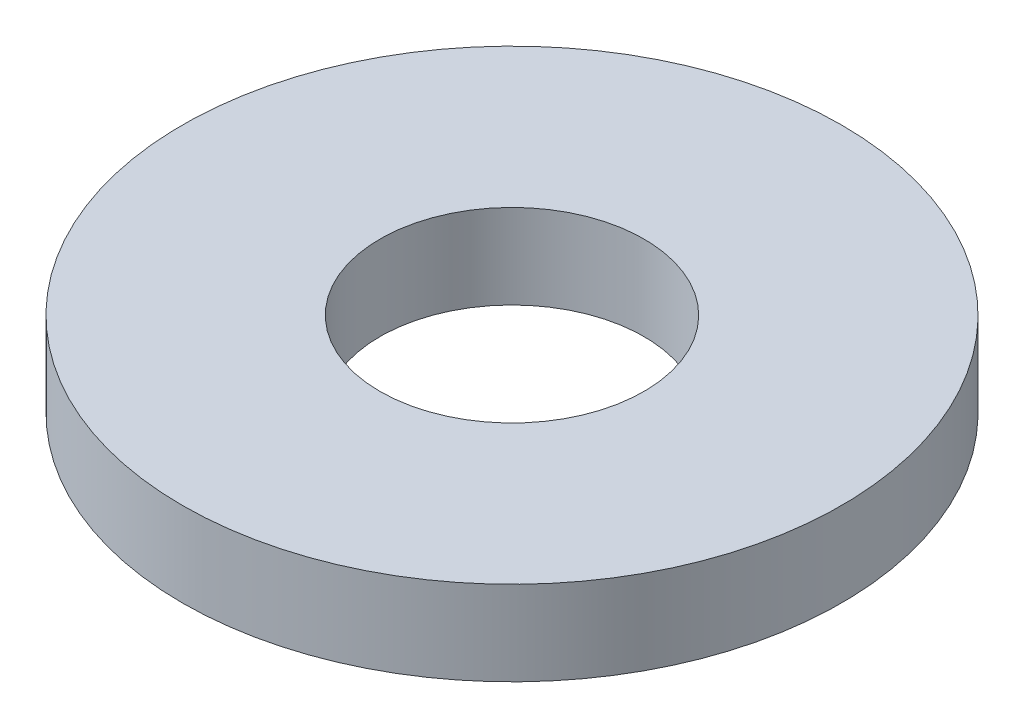
ISO-10303-21;
HEADER;
FILE_DESCRIPTION(('STEP AP214'),'2;1');
FILE_NAME('part.step','',(''),(''),'','','');
FILE_SCHEMA(('AUTOMOTIVE_DESIGN { 1 0 10303 214 1 1 1 1 }'));
ENDSEC;
DATA;
#1=APPLICATION_CONTEXT('core data for automotive mechanical design processes');
#2=APPLICATION_PROTOCOL_DEFINITION('international standard','automotive_design',2000,#1);
#3=PRODUCT_CONTEXT('',#1,'mechanical');
#4=PRODUCT('Part','Part','',(#3));
#5=PRODUCT_RELATED_PRODUCT_CATEGORY('part','',(#4));
#6=PRODUCT_DEFINITION_FORMATION('','',#4);
#7=PRODUCT_DEFINITION_CONTEXT('part definition',#1,'design');
#8=PRODUCT_DEFINITION('design','',#6,#7);
#9=PRODUCT_DEFINITION_SHAPE('','',#8);
#10=(LENGTH_UNIT() NAMED_UNIT(*) SI_UNIT(.MILLI.,.METRE.));
#11=(NAMED_UNIT(*) PLANE_ANGLE_UNIT() SI_UNIT($,.RADIAN.));
#12=(NAMED_UNIT(*) SI_UNIT($,.STERADIAN.) SOLID_ANGLE_UNIT());
#13=UNCERTAINTY_MEASURE_WITH_UNIT(LENGTH_MEASURE(1.E-05),#10,'distance_accuracy_value','');
#14=(GEOMETRIC_REPRESENTATION_CONTEXT(3) GLOBAL_UNCERTAINTY_ASSIGNED_CONTEXT((#13)) GLOBAL_UNIT_ASSIGNED_CONTEXT((#10,
#11,#12)) REPRESENTATION_CONTEXT('',''));
#15=CARTESIAN_POINT('',(0.,0.,0.));
#16=DIRECTION('',(0.,0.,1.));
#17=DIRECTION('',(1.,0.,0.));
#18=AXIS2_PLACEMENT_3D('',#15,#16,#17);
#19=CARTESIAN_POINT('',(0.,1.016,0.));
#20=DIRECTION('',(0.,-1.,0.));
#21=DIRECTION('',(0.,0.,-1.));
#22=AXIS2_PLACEMENT_3D('',#19,#20,#21);
#23=CYLINDRICAL_SURFACE('',#22,3.9624);
#24=CARTESIAN_POINT('',(0.,1.016,0.));
#25=DIRECTION('',(0.,1.,0.));
#26=DIRECTION('',(0.,0.,1.));
#27=AXIS2_PLACEMENT_3D('',#24,#25,#26);
#28=CIRCLE('',#27,3.9624);
#29=CARTESIAN_POINT('',(0.,1.016,3.9624));
#30=VERTEX_POINT('',#29);
#31=EDGE_CURVE('E10',#30,#30,#28,.T.);
#32=ORIENTED_EDGE('',*,*,#31,.F.);
#33=EDGE_LOOP('',(#32));
#34=FACE_BOUND('',#33,.T.);
#35=CARTESIAN_POINT('',(0.,0.,0.));
#36=DIRECTION('',(0.,1.,0.));
#37=DIRECTION('',(0.,0.,1.));
#38=AXIS2_PLACEMENT_3D('',#35,#36,#37);
#39=CIRCLE('',#38,3.9624);
#40=CARTESIAN_POINT('',(0.,0.,3.9624));
#41=VERTEX_POINT('',#40);
#42=EDGE_CURVE('E33',#41,#41,#39,.T.);
#43=ORIENTED_EDGE('',*,*,#42,.T.);
#44=EDGE_LOOP('',(#43));
#45=FACE_BOUND('',#44,.T.);
#46=ADVANCED_FACE('F30',(#34,#45),#23,.T.);
#47=CARTESIAN_POINT('',(0.,1.016,0.));
#48=DIRECTION('',(0.,1.,0.));
#49=DIRECTION('',(0.,0.,1.));
#50=AXIS2_PLACEMENT_3D('',#47,#48,#49);
#51=PLANE('',#50);
#52=CARTESIAN_POINT('',(0.,1.016,0.));
#53=DIRECTION('',(0.,1.,0.));
#54=DIRECTION('',(0.,0.,1.));
#55=AXIS2_PLACEMENT_3D('',#52,#53,#54);
#56=CIRCLE('',#55,1.5875);
#57=CARTESIAN_POINT('',(0.,1.016,1.5875));
#58=VERTEX_POINT('',#57);
#59=EDGE_CURVE('E42',#58,#58,#56,.T.);
#60=ORIENTED_EDGE('',*,*,#59,.F.);
#61=EDGE_LOOP('',(#60));
#62=FACE_BOUND('',#61,.T.);
#63=ORIENTED_EDGE('',*,*,#31,.T.);
#64=EDGE_LOOP('',(#63));
#65=FACE_BOUND('',#64,.T.);
#66=ADVANCED_FACE('F57',(#62,#65),#51,.T.);
#67=CARTESIAN_POINT('',(0.,0.,0.));
#68=DIRECTION('',(0.,1.,0.));
#69=DIRECTION('',(0.,0.,1.));
#70=AXIS2_PLACEMENT_3D('',#67,#68,#69);
#71=PLANE('',#70);
#72=CARTESIAN_POINT('',(0.,0.,0.));
#73=DIRECTION('',(0.,1.,0.));
#74=DIRECTION('',(0.,0.,1.));
#75=AXIS2_PLACEMENT_3D('',#72,#73,#74);
#76=CIRCLE('',#75,1.5875);
#77=CARTESIAN_POINT('',(0.,0.,1.5875));
#78=VERTEX_POINT('',#77);
#79=EDGE_CURVE('E40',#78,#78,#76,.T.);
#80=ORIENTED_EDGE('',*,*,#79,.T.);
#81=EDGE_LOOP('',(#80));
#82=FACE_BOUND('',#81,.T.);
#83=ORIENTED_EDGE('',*,*,#42,.F.);
#84=EDGE_LOOP('',(#83));
#85=FACE_BOUND('',#84,.T.);
#86=ADVANCED_FACE('F48',(#82,#85),#71,.F.);
#87=CARTESIAN_POINT('',(0.,0.,0.));
#88=DIRECTION('',(0.,1.,0.));
#89=DIRECTION('',(0.,0.,1.));
#90=AXIS2_PLACEMENT_3D('',#87,#88,#89);
#91=CYLINDRICAL_SURFACE('',#90,1.5875);
#92=ORIENTED_EDGE('',*,*,#79,.F.);
#93=EDGE_LOOP('',(#92));
#94=FACE_BOUND('',#93,.T.);
#95=ORIENTED_EDGE('',*,*,#59,.T.);
#96=EDGE_LOOP('',(#95));
#97=FACE_BOUND('',#96,.T.);
#98=ADVANCED_FACE('F51',(#94,#97),#91,.F.);
#99=CLOSED_SHELL('',(#46,#66,#86,#98));
#100=MANIFOLD_SOLID_BREP('B2',#99);
#101=ADVANCED_BREP_SHAPE_REPRESENTATION('',(#18,#100),#14);
#102=SHAPE_DEFINITION_REPRESENTATION(#9,#101);
ENDSEC;
END-ISO-10303-21;
